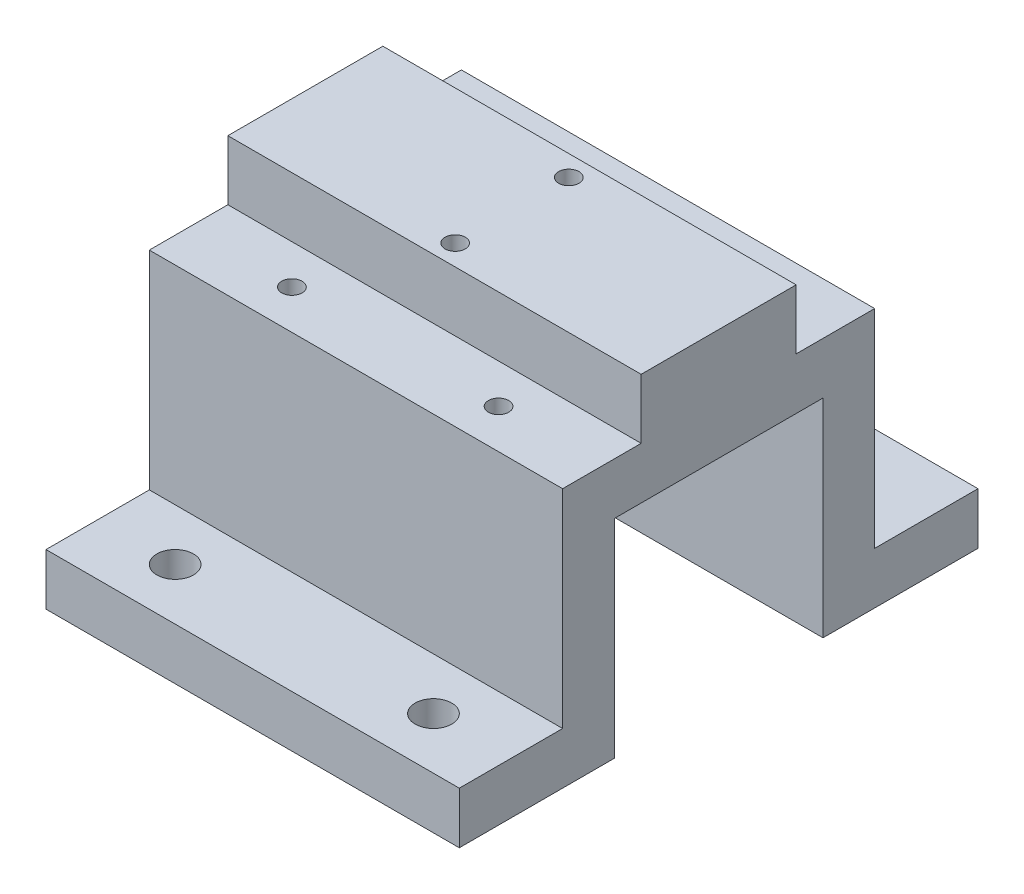
ISO-10303-21;
HEADER;
FILE_DESCRIPTION(('STEP AP214'),'2;1');
FILE_NAME('part.step','',(''),(''),'','','');
FILE_SCHEMA(('AUTOMOTIVE_DESIGN { 1 0 10303 214 1 1 1 1 }'));
ENDSEC;
DATA;
#1=APPLICATION_CONTEXT('core data for automotive mechanical design processes');
#2=APPLICATION_PROTOCOL_DEFINITION('international standard','automotive_design',2000,#1);
#3=PRODUCT_CONTEXT('',#1,'mechanical');
#4=PRODUCT('Part','Part','',(#3));
#5=PRODUCT_RELATED_PRODUCT_CATEGORY('part','',(#4));
#6=PRODUCT_DEFINITION_FORMATION('','',#4);
#7=PRODUCT_DEFINITION_CONTEXT('part definition',#1,'design');
#8=PRODUCT_DEFINITION('design','',#6,#7);
#9=PRODUCT_DEFINITION_SHAPE('','',#8);
#10=(LENGTH_UNIT() NAMED_UNIT(*) SI_UNIT(.MILLI.,.METRE.));
#11=(NAMED_UNIT(*) PLANE_ANGLE_UNIT() SI_UNIT($,.RADIAN.));
#12=(NAMED_UNIT(*) SI_UNIT($,.STERADIAN.) SOLID_ANGLE_UNIT());
#13=UNCERTAINTY_MEASURE_WITH_UNIT(LENGTH_MEASURE(1.E-05),#10,'distance_accuracy_value','');
#14=(GEOMETRIC_REPRESENTATION_CONTEXT(3) GLOBAL_UNCERTAINTY_ASSIGNED_CONTEXT((#13)) GLOBAL_UNIT_ASSIGNED_CONTEXT((#10,
#11,#12)) REPRESENTATION_CONTEXT('',''));
#15=CARTESIAN_POINT('',(0.,0.,0.));
#16=DIRECTION('',(0.,0.,1.));
#17=DIRECTION('',(1.,0.,0.));
#18=AXIS2_PLACEMENT_3D('',#15,#16,#17);
#19=CARTESIAN_POINT('',(50.8,31.877,0.));
#20=DIRECTION('',(0.,-1.,0.));
#21=DIRECTION('',(0.,0.,-1.));
#22=AXIS2_PLACEMENT_3D('',#19,#20,#21);
#23=PLANE('',#22);
#24=CARTESIAN_POINT('',(12.7,31.877,-14.351));
#25=DIRECTION('',(0.,1.,0.));
#26=DIRECTION('',(0.,0.,1.));
#27=AXIS2_PLACEMENT_3D('',#24,#25,#26);
#28=CIRCLE('',#27,1.24999999999999);
#29=CARTESIAN_POINT('',(12.7,31.877,-13.101));
#30=VERTEX_POINT('',#29);
#31=EDGE_CURVE('E388',#30,#30,#28,.T.);
#32=ORIENTED_EDGE('',*,*,#31,.F.);
#33=EDGE_LOOP('',(#32));
#34=FACE_BOUND('',#33,.T.);
#35=CARTESIAN_POINT('',(38.1,31.877,-14.351));
#36=DIRECTION('',(0.,1.,0.));
#37=DIRECTION('',(0.,0.,1.));
#38=AXIS2_PLACEMENT_3D('',#35,#36,#37);
#39=CIRCLE('',#38,1.24999999999999);
#40=CARTESIAN_POINT('',(38.1,31.877,-13.101));
#41=VERTEX_POINT('',#40);
#42=EDGE_CURVE('E424',#41,#41,#39,.T.);
#43=ORIENTED_EDGE('',*,*,#42,.F.);
#44=EDGE_LOOP('',(#43));
#45=FACE_BOUND('',#44,.T.);
#46=DIRECTION('',(-1.,0.,0.));
#47=VECTOR('',#46,1.);
#48=CARTESIAN_POINT('',(50.8,31.877,-9.525));
#49=LINE('',#48,#47);
#50=CARTESIAN_POINT('',(50.8,31.877,-9.525));
#51=VERTEX_POINT('',#50);
#52=CARTESIAN_POINT('',(0.,31.877,-9.525));
#53=VERTEX_POINT('',#52);
#54=EDGE_CURVE('E60',#51,#53,#49,.T.);
#55=ORIENTED_EDGE('',*,*,#54,.F.);
#56=DIRECTION('',(0.,0.,1.));
#57=VECTOR('',#56,1.);
#58=CARTESIAN_POINT('',(50.8,31.877,0.));
#59=LINE('',#58,#57);
#60=CARTESIAN_POINT('',(50.8,31.877,-19.177));
#61=VERTEX_POINT('',#60);
#62=EDGE_CURVE('E231',#61,#51,#59,.T.);
#63=ORIENTED_EDGE('',*,*,#62,.F.);
#64=DIRECTION('',(-1.,0.,0.));
#65=VECTOR('',#64,1.);
#66=CARTESIAN_POINT('',(50.8,31.877,-19.177));
#67=LINE('',#66,#65);
#68=CARTESIAN_POINT('',(0.,31.877,-19.177));
#69=VERTEX_POINT('',#68);
#70=EDGE_CURVE('E11',#61,#69,#67,.T.);
#71=ORIENTED_EDGE('',*,*,#70,.T.);
#72=DIRECTION('',(0.,0.,1.));
#73=VECTOR('',#72,1.);
#74=CARTESIAN_POINT('',(0.,31.877,0.));
#75=LINE('',#74,#73);
#76=EDGE_CURVE('E272',#69,#53,#75,.T.);
#77=ORIENTED_EDGE('',*,*,#76,.T.);
#78=EDGE_LOOP('',(#55,#63,#71,#77));
#79=FACE_BOUND('',#78,.T.);
#80=ADVANCED_FACE('F44',(#34,#45,#79),#23,.F.);
#81=CARTESIAN_POINT('',(12.7,31.877,14.351));
#82=DIRECTION('',(0.,1.,0.));
#83=DIRECTION('',(0.,0.,1.));
#84=AXIS2_PLACEMENT_3D('',#81,#82,#83);
#85=CIRCLE('',#84,1.24999999999999);
#86=CARTESIAN_POINT('',(12.7,31.877,15.601));
#87=VERTEX_POINT('',#86);
#88=EDGE_CURVE('E379',#87,#87,#85,.T.);
#89=ORIENTED_EDGE('',*,*,#88,.F.);
#90=EDGE_LOOP('',(#89));
#91=FACE_BOUND('',#90,.T.);
#92=CARTESIAN_POINT('',(38.1,31.877,14.351));
#93=DIRECTION('',(0.,1.,0.));
#94=DIRECTION('',(0.,0.,1.));
#95=AXIS2_PLACEMENT_3D('',#92,#93,#94);
#96=CIRCLE('',#95,1.24999999999999);
#97=CARTESIAN_POINT('',(38.1,31.877,15.601));
#98=VERTEX_POINT('',#97);
#99=EDGE_CURVE('E389',#98,#98,#96,.T.);
#100=ORIENTED_EDGE('',*,*,#99,.F.);
#101=EDGE_LOOP('',(#100));
#102=FACE_BOUND('',#101,.T.);
#103=DIRECTION('',(1.,0.,0.));
#104=VECTOR('',#103,1.);
#105=CARTESIAN_POINT('',(50.8,31.877,9.525));
#106=LINE('',#105,#104);
#107=CARTESIAN_POINT('',(0.,31.877,9.525));
#108=VERTEX_POINT('',#107);
#109=CARTESIAN_POINT('',(50.8,31.877,9.525));
#110=VERTEX_POINT('',#109);
#111=EDGE_CURVE('E68',#108,#110,#106,.T.);
#112=ORIENTED_EDGE('',*,*,#111,.F.);
#113=CARTESIAN_POINT('',(0.,31.877,19.177));
#114=VERTEX_POINT('',#113);
#115=EDGE_CURVE('E271',#108,#114,#75,.T.);
#116=ORIENTED_EDGE('',*,*,#115,.T.);
#117=DIRECTION('',(-1.,0.,0.));
#118=VECTOR('',#117,1.);
#119=CARTESIAN_POINT('',(50.8,31.877,19.177));
#120=LINE('',#119,#118);
#121=CARTESIAN_POINT('',(50.8,31.877,19.177));
#122=VERTEX_POINT('',#121);
#123=EDGE_CURVE('E53',#122,#114,#120,.T.);
#124=ORIENTED_EDGE('',*,*,#123,.F.);
#125=EDGE_CURVE('E229',#110,#122,#59,.T.);
#126=ORIENTED_EDGE('',*,*,#125,.F.);
#127=EDGE_LOOP('',(#112,#116,#124,#126));
#128=FACE_BOUND('',#127,.T.);
#129=ADVANCED_FACE('F442',(#91,#102,#128),#23,.F.);
#130=CARTESIAN_POINT('',(50.8,0.,-19.177));
#131=DIRECTION('',(0.,0.,-1.));
#132=DIRECTION('',(0.,1.,0.));
#133=AXIS2_PLACEMENT_3D('',#130,#131,#132);
#134=PLANE('',#133);
#135=DIRECTION('',(0.,-1.,0.));
#136=VECTOR('',#135,1.);
#137=CARTESIAN_POINT('',(0.,0.,-19.177));
#138=LINE('',#137,#136);
#139=CARTESIAN_POINT('',(0.,6.35,-19.177));
#140=VERTEX_POINT('',#139);
#141=EDGE_CURVE('E224',#69,#140,#138,.T.);
#142=ORIENTED_EDGE('',*,*,#141,.F.);
#143=ORIENTED_EDGE('',*,*,#70,.F.);
#144=DIRECTION('',(0.,-1.,0.));
#145=VECTOR('',#144,1.);
#146=CARTESIAN_POINT('',(50.8,0.,-19.177));
#147=LINE('',#146,#145);
#148=CARTESIAN_POINT('',(50.8,6.35,-19.177));
#149=VERTEX_POINT('',#148);
#150=EDGE_CURVE('E225',#61,#149,#147,.T.);
#151=ORIENTED_EDGE('',*,*,#150,.T.);
#152=DIRECTION('',(-1.,0.,0.));
#153=VECTOR('',#152,1.);
#154=CARTESIAN_POINT('',(50.8,6.35,-19.177));
#155=LINE('',#154,#153);
#156=EDGE_CURVE('E268',#149,#140,#155,.T.);
#157=ORIENTED_EDGE('',*,*,#156,.T.);
#158=EDGE_LOOP('',(#142,#143,#151,#157));
#159=FACE_BOUND('',#158,.T.);
#160=ADVANCED_FACE('F46',(#159),#134,.T.);
#161=CARTESIAN_POINT('',(50.8,0.,19.177));
#162=DIRECTION('',(0.,0.,-1.));
#163=DIRECTION('',(0.,1.,0.));
#164=AXIS2_PLACEMENT_3D('',#161,#162,#163);
#165=PLANE('',#164);
#166=DIRECTION('',(0.,-1.,0.));
#167=VECTOR('',#166,1.);
#168=CARTESIAN_POINT('',(0.,0.,19.177));
#169=LINE('',#168,#167);
#170=CARTESIAN_POINT('',(0.,6.35,19.177));
#171=VERTEX_POINT('',#170);
#172=EDGE_CURVE('E275',#114,#171,#169,.T.);
#173=ORIENTED_EDGE('',*,*,#172,.T.);
#174=DIRECTION('',(-1.,0.,0.));
#175=VECTOR('',#174,1.);
#176=CARTESIAN_POINT('',(50.8,6.35,19.177));
#177=LINE('',#176,#175);
#178=CARTESIAN_POINT('',(50.8,6.35,19.177));
#179=VERTEX_POINT('',#178);
#180=EDGE_CURVE('E339',#179,#171,#177,.T.);
#181=ORIENTED_EDGE('',*,*,#180,.F.);
#182=DIRECTION('',(0.,-1.,0.));
#183=VECTOR('',#182,1.);
#184=CARTESIAN_POINT('',(50.8,0.,19.177));
#185=LINE('',#184,#183);
#186=EDGE_CURVE('E234',#122,#179,#185,.T.);
#187=ORIENTED_EDGE('',*,*,#186,.F.);
#188=ORIENTED_EDGE('',*,*,#123,.T.);
#189=EDGE_LOOP('',(#173,#181,#187,#188));
#190=FACE_BOUND('',#189,.T.);
#191=ADVANCED_FACE('F349',(#190),#165,.F.);
#192=CARTESIAN_POINT('',(50.8,6.35,0.));
#193=DIRECTION('',(0.,-1.,0.));
#194=DIRECTION('',(0.,0.,-1.));
#195=AXIS2_PLACEMENT_3D('',#192,#193,#194);
#196=PLANE('',#195);
#197=CARTESIAN_POINT('',(9.525,6.35,25.527));
#198=DIRECTION('',(0.,1.,0.));
#199=DIRECTION('',(0.,0.,1.));
#200=AXIS2_PLACEMENT_3D('',#197,#198,#199);
#201=CIRCLE('',#200,2.24999999999999);
#202=CARTESIAN_POINT('',(9.525,6.35,27.777));
#203=VERTEX_POINT('',#202);
#204=EDGE_CURVE('E399',#203,#203,#201,.T.);
#205=ORIENTED_EDGE('',*,*,#204,.F.);
#206=EDGE_LOOP('',(#205));
#207=FACE_BOUND('',#206,.T.);
#208=CARTESIAN_POINT('',(41.275,6.35,25.527));
#209=DIRECTION('',(0.,1.,0.));
#210=DIRECTION('',(0.,0.,1.));
#211=AXIS2_PLACEMENT_3D('',#208,#209,#210);
#212=CIRCLE('',#211,2.24999999999999);
#213=CARTESIAN_POINT('',(41.275,6.35,27.777));
#214=VERTEX_POINT('',#213);
#215=EDGE_CURVE('E383',#214,#214,#212,.T.);
#216=ORIENTED_EDGE('',*,*,#215,.F.);
#217=EDGE_LOOP('',(#216));
#218=FACE_BOUND('',#217,.T.);
#219=DIRECTION('',(0.,0.,1.));
#220=VECTOR('',#219,1.);
#221=CARTESIAN_POINT('',(0.,6.35,0.));
#222=LINE('',#221,#220);
#223=CARTESIAN_POINT('',(0.,6.35,31.877));
#224=VERTEX_POINT('',#223);
#225=EDGE_CURVE('E278',#171,#224,#222,.T.);
#226=ORIENTED_EDGE('',*,*,#225,.T.);
#227=DIRECTION('',(-1.,0.,0.));
#228=VECTOR('',#227,1.);
#229=CARTESIAN_POINT('',(50.8,6.35,31.877));
#230=LINE('',#229,#228);
#231=CARTESIAN_POINT('',(50.8,6.35,31.877));
#232=VERTEX_POINT('',#231);
#233=EDGE_CURVE('E336',#232,#224,#230,.T.);
#234=ORIENTED_EDGE('',*,*,#233,.F.);
#235=DIRECTION('',(0.,0.,1.));
#236=VECTOR('',#235,1.);
#237=CARTESIAN_POINT('',(50.8,6.35,0.));
#238=LINE('',#237,#236);
#239=EDGE_CURVE('E237',#179,#232,#238,.T.);
#240=ORIENTED_EDGE('',*,*,#239,.F.);
#241=ORIENTED_EDGE('',*,*,#180,.T.);
#242=EDGE_LOOP('',(#226,#234,#240,#241));
#243=FACE_BOUND('',#242,.T.);
#244=ADVANCED_FACE('F359',(#207,#218,#243),#196,.F.);
#245=CARTESIAN_POINT('',(50.8,0.,31.877));
#246=DIRECTION('',(0.,0.,1.));
#247=DIRECTION('',(1.,0.,0.));
#248=AXIS2_PLACEMENT_3D('',#245,#246,#247);
#249=PLANE('',#248);
#250=DIRECTION('',(0.,1.,0.));
#251=VECTOR('',#250,1.);
#252=CARTESIAN_POINT('',(0.,0.,31.877));
#253=LINE('',#252,#251);
#254=CARTESIAN_POINT('',(0.,0.,31.877));
#255=VERTEX_POINT('',#254);
#256=EDGE_CURVE('E282',#255,#224,#253,.T.);
#257=ORIENTED_EDGE('',*,*,#256,.F.);
#258=DIRECTION('',(-1.,0.,0.));
#259=VECTOR('',#258,1.);
#260=CARTESIAN_POINT('',(50.8,0.,31.877));
#261=LINE('',#260,#259);
#262=CARTESIAN_POINT('',(50.8,0.,31.877));
#263=VERTEX_POINT('',#262);
#264=EDGE_CURVE('E333',#263,#255,#261,.T.);
#265=ORIENTED_EDGE('',*,*,#264,.F.);
#266=DIRECTION('',(0.,1.,0.));
#267=VECTOR('',#266,1.);
#268=CARTESIAN_POINT('',(50.8,0.,31.877));
#269=LINE('',#268,#267);
#270=EDGE_CURVE('E240',#263,#232,#269,.T.);
#271=ORIENTED_EDGE('',*,*,#270,.T.);
#272=ORIENTED_EDGE('',*,*,#233,.T.);
#273=EDGE_LOOP('',(#257,#265,#271,#272));
#274=FACE_BOUND('',#273,.T.);
#275=ADVANCED_FACE('F454',(#274),#249,.T.);
#276=CARTESIAN_POINT('',(50.8,0.,0.));
#277=DIRECTION('',(0.,1.,0.));
#278=DIRECTION('',(0.,0.,1.));
#279=AXIS2_PLACEMENT_3D('',#276,#277,#278);
#280=PLANE('',#279);
#281=CARTESIAN_POINT('',(9.525,0.,25.527));
#282=DIRECTION('',(0.,1.,0.));
#283=DIRECTION('',(0.,0.,1.));
#284=AXIS2_PLACEMENT_3D('',#281,#282,#283);
#285=CIRCLE('',#284,2.25);
#286=CARTESIAN_POINT('',(9.525,0.,27.777));
#287=VERTEX_POINT('',#286);
#288=EDGE_CURVE('E396',#287,#287,#285,.T.);
#289=ORIENTED_EDGE('',*,*,#288,.T.);
#290=EDGE_LOOP('',(#289));
#291=FACE_BOUND('',#290,.T.);
#292=CARTESIAN_POINT('',(41.275,0.,25.527));
#293=DIRECTION('',(0.,1.,0.));
#294=DIRECTION('',(0.,0.,1.));
#295=AXIS2_PLACEMENT_3D('',#292,#293,#294);
#296=CIRCLE('',#295,2.25);
#297=CARTESIAN_POINT('',(41.275,0.,27.777));
#298=VERTEX_POINT('',#297);
#299=EDGE_CURVE('E373',#298,#298,#296,.T.);
#300=ORIENTED_EDGE('',*,*,#299,.T.);
#301=EDGE_LOOP('',(#300));
#302=FACE_BOUND('',#301,.T.);
#303=CARTESIAN_POINT('',(12.7,0.,14.351));
#304=DIRECTION('',(0.,1.,0.));
#305=DIRECTION('',(0.,0.,1.));
#306=AXIS2_PLACEMENT_3D('',#303,#304,#305);
#307=CIRCLE('',#306,1.25);
#308=CARTESIAN_POINT('',(12.7,0.,15.601));
#309=VERTEX_POINT('',#308);
#310=EDGE_CURVE('E393',#309,#309,#307,.T.);
#311=ORIENTED_EDGE('',*,*,#310,.T.);
#312=EDGE_LOOP('',(#311));
#313=FACE_BOUND('',#312,.T.);
#314=CARTESIAN_POINT('',(38.1,0.,14.351));
#315=DIRECTION('',(0.,1.,0.));
#316=DIRECTION('',(0.,0.,1.));
#317=AXIS2_PLACEMENT_3D('',#314,#315,#316);
#318=CIRCLE('',#317,1.24999999999999);
#319=CARTESIAN_POINT('',(38.1,0.,15.601));
#320=VERTEX_POINT('',#319);
#321=EDGE_CURVE('E386',#320,#320,#318,.T.);
#322=ORIENTED_EDGE('',*,*,#321,.T.);
#323=EDGE_LOOP('',(#322));
#324=FACE_BOUND('',#323,.T.);
#325=DIRECTION('',(0.,0.,-1.));
#326=VECTOR('',#325,1.);
#327=CARTESIAN_POINT('',(0.,0.,0.));
#328=LINE('',#327,#326);
#329=CARTESIAN_POINT('',(0.,0.,12.827));
#330=VERTEX_POINT('',#329);
#331=EDGE_CURVE('E286',#255,#330,#328,.T.);
#332=ORIENTED_EDGE('',*,*,#331,.T.);
#333=DIRECTION('',(-1.,0.,0.));
#334=VECTOR('',#333,1.);
#335=CARTESIAN_POINT('',(50.8,0.,12.827));
#336=LINE('',#335,#334);
#337=CARTESIAN_POINT('',(50.8,0.,12.827));
#338=VERTEX_POINT('',#337);
#339=EDGE_CURVE('E329',#338,#330,#336,.T.);
#340=ORIENTED_EDGE('',*,*,#339,.F.);
#341=DIRECTION('',(0.,0.,-1.));
#342=VECTOR('',#341,1.);
#343=CARTESIAN_POINT('',(50.8,0.,0.));
#344=LINE('',#343,#342);
#345=EDGE_CURVE('E244',#263,#338,#344,.T.);
#346=ORIENTED_EDGE('',*,*,#345,.F.);
#347=ORIENTED_EDGE('',*,*,#264,.T.);
#348=EDGE_LOOP('',(#332,#340,#346,#347));
#349=FACE_BOUND('',#348,.T.);
#350=ADVANCED_FACE('F458',(#291,#302,#313,#324,#349),#280,.F.);
#351=CARTESIAN_POINT('',(50.8,0.,12.827));
#352=DIRECTION('',(0.,0.,1.));
#353=DIRECTION('',(1.,0.,0.));
#354=AXIS2_PLACEMENT_3D('',#351,#352,#353);
#355=PLANE('',#354);
#356=DIRECTION('',(0.,1.,0.));
#357=VECTOR('',#356,1.);
#358=CARTESIAN_POINT('',(0.,0.,12.827));
#359=LINE('',#358,#357);
#360=CARTESIAN_POINT('',(0.,25.527,12.827));
#361=VERTEX_POINT('',#360);
#362=EDGE_CURVE('E289',#330,#361,#359,.T.);
#363=ORIENTED_EDGE('',*,*,#362,.T.);
#364=DIRECTION('',(-1.,0.,0.));
#365=VECTOR('',#364,1.);
#366=CARTESIAN_POINT('',(50.8,25.527,12.827));
#367=LINE('',#366,#365);
#368=CARTESIAN_POINT('',(50.8,25.527,12.827));
#369=VERTEX_POINT('',#368);
#370=EDGE_CURVE('E325',#369,#361,#367,.T.);
#371=ORIENTED_EDGE('',*,*,#370,.F.);
#372=DIRECTION('',(0.,1.,0.));
#373=VECTOR('',#372,1.);
#374=CARTESIAN_POINT('',(50.8,0.,12.827));
#375=LINE('',#374,#373);
#376=EDGE_CURVE('E247',#338,#369,#375,.T.);
#377=ORIENTED_EDGE('',*,*,#376,.F.);
#378=ORIENTED_EDGE('',*,*,#339,.T.);
#379=EDGE_LOOP('',(#363,#371,#377,#378));
#380=FACE_BOUND('',#379,.T.);
#381=ADVANCED_FACE('F462',(#380),#355,.F.);
#382=CARTESIAN_POINT('',(50.8,25.527,0.));
#383=DIRECTION('',(0.,1.,0.));
#384=DIRECTION('',(0.,0.,1.));
#385=AXIS2_PLACEMENT_3D('',#382,#383,#384);
#386=PLANE('',#385);
#387=DIRECTION('',(0.,0.,-1.));
#388=VECTOR('',#387,1.);
#389=CARTESIAN_POINT('',(0.,25.527,0.));
#390=LINE('',#389,#388);
#391=CARTESIAN_POINT('',(0.,25.527,-12.827));
#392=VERTEX_POINT('',#391);
#393=EDGE_CURVE('E292',#361,#392,#390,.T.);
#394=ORIENTED_EDGE('',*,*,#393,.T.);
#395=DIRECTION('',(-1.,0.,0.));
#396=VECTOR('',#395,1.);
#397=CARTESIAN_POINT('',(50.8,25.527,-12.827));
#398=LINE('',#397,#396);
#399=CARTESIAN_POINT('',(50.8,25.527,-12.827));
#400=VERTEX_POINT('',#399);
#401=EDGE_CURVE('E322',#400,#392,#398,.T.);
#402=ORIENTED_EDGE('',*,*,#401,.F.);
#403=DIRECTION('',(0.,0.,-1.));
#404=VECTOR('',#403,1.);
#405=CARTESIAN_POINT('',(50.8,25.527,0.));
#406=LINE('',#405,#404);
#407=EDGE_CURVE('E250',#369,#400,#406,.T.);
#408=ORIENTED_EDGE('',*,*,#407,.F.);
#409=ORIENTED_EDGE('',*,*,#370,.T.);
#410=EDGE_LOOP('',(#394,#402,#408,#409));
#411=FACE_BOUND('',#410,.T.);
#412=ADVANCED_FACE('F466',(#411),#386,.F.);
#413=CARTESIAN_POINT('',(50.8,0.,-12.827));
#414=DIRECTION('',(0.,0.,1.));
#415=DIRECTION('',(1.,0.,0.));
#416=AXIS2_PLACEMENT_3D('',#413,#414,#415);
#417=PLANE('',#416);
#418=DIRECTION('',(0.,1.,0.));
#419=VECTOR('',#418,1.);
#420=CARTESIAN_POINT('',(0.,0.,-12.827));
#421=LINE('',#420,#419);
#422=CARTESIAN_POINT('',(0.,0.,-12.827));
#423=VERTEX_POINT('',#422);
#424=EDGE_CURVE('E296',#423,#392,#421,.T.);
#425=ORIENTED_EDGE('',*,*,#424,.F.);
#426=DIRECTION('',(-1.,0.,0.));
#427=VECTOR('',#426,1.);
#428=CARTESIAN_POINT('',(50.8,0.,-12.827));
#429=LINE('',#428,#427);
#430=CARTESIAN_POINT('',(50.8,0.,-12.827));
#431=VERTEX_POINT('',#430);
#432=EDGE_CURVE('E319',#431,#423,#429,.T.);
#433=ORIENTED_EDGE('',*,*,#432,.F.);
#434=DIRECTION('',(0.,1.,0.));
#435=VECTOR('',#434,1.);
#436=CARTESIAN_POINT('',(50.8,0.,-12.827));
#437=LINE('',#436,#435);
#438=EDGE_CURVE('E253',#431,#400,#437,.T.);
#439=ORIENTED_EDGE('',*,*,#438,.T.);
#440=ORIENTED_EDGE('',*,*,#401,.T.);
#441=EDGE_LOOP('',(#425,#433,#439,#440));
#442=FACE_BOUND('',#441,.T.);
#443=ADVANCED_FACE('F470',(#442),#417,.T.);
#444=CARTESIAN_POINT('',(50.8,0.,0.));
#445=DIRECTION('',(0.,-1.,0.));
#446=DIRECTION('',(0.,0.,-1.));
#447=AXIS2_PLACEMENT_3D('',#444,#445,#446);
#448=PLANE('',#447);
#449=CARTESIAN_POINT('',(9.525,0.,-25.527));
#450=DIRECTION('',(0.,1.,0.));
#451=DIRECTION('',(0.,0.,1.));
#452=AXIS2_PLACEMENT_3D('',#449,#450,#451);
#453=CIRCLE('',#452,2.25);
#454=CARTESIAN_POINT('',(9.525,0.,-23.277));
#455=VERTEX_POINT('',#454);
#456=EDGE_CURVE('E372',#455,#455,#453,.T.);
#457=ORIENTED_EDGE('',*,*,#456,.T.);
#458=EDGE_LOOP('',(#457));
#459=FACE_BOUND('',#458,.T.);
#460=CARTESIAN_POINT('',(41.275,0.,-25.527));
#461=DIRECTION('',(0.,1.,0.));
#462=DIRECTION('',(0.,0.,1.));
#463=AXIS2_PLACEMENT_3D('',#460,#461,#462);
#464=CIRCLE('',#463,2.25);
#465=CARTESIAN_POINT('',(41.275,0.,-23.277));
#466=VERTEX_POINT('',#465);
#467=EDGE_CURVE('E376',#466,#466,#464,.T.);
#468=ORIENTED_EDGE('',*,*,#467,.T.);
#469=EDGE_LOOP('',(#468));
#470=FACE_BOUND('',#469,.T.);
#471=CARTESIAN_POINT('',(12.7,0.,-14.351));
#472=DIRECTION('',(0.,1.,0.));
#473=DIRECTION('',(0.,0.,1.));
#474=AXIS2_PLACEMENT_3D('',#471,#472,#473);
#475=CIRCLE('',#474,1.25);
#476=CARTESIAN_POINT('',(12.7,0.,-13.101));
#477=VERTEX_POINT('',#476);
#478=EDGE_CURVE('E420',#477,#477,#475,.T.);
#479=ORIENTED_EDGE('',*,*,#478,.T.);
#480=EDGE_LOOP('',(#479));
#481=FACE_BOUND('',#480,.T.);
#482=CARTESIAN_POINT('',(38.1,0.,-14.351));
#483=DIRECTION('',(0.,1.,0.));
#484=DIRECTION('',(0.,0.,1.));
#485=AXIS2_PLACEMENT_3D('',#482,#483,#484);
#486=CIRCLE('',#485,1.24999999999999);
#487=CARTESIAN_POINT('',(38.1,0.,-13.101));
#488=VERTEX_POINT('',#487);
#489=EDGE_CURVE('E184',#488,#488,#486,.T.);
#490=ORIENTED_EDGE('',*,*,#489,.T.);
#491=EDGE_LOOP('',(#490));
#492=FACE_BOUND('',#491,.T.);
#493=DIRECTION('',(0.,0.,1.));
#494=VECTOR('',#493,1.);
#495=CARTESIAN_POINT('',(0.,0.,0.));
#496=LINE('',#495,#494);
#497=CARTESIAN_POINT('',(0.,0.,-31.877));
#498=VERTEX_POINT('',#497);
#499=EDGE_CURVE('E300',#498,#423,#496,.T.);
#500=ORIENTED_EDGE('',*,*,#499,.F.);
#501=DIRECTION('',(-1.,0.,0.));
#502=VECTOR('',#501,1.);
#503=CARTESIAN_POINT('',(50.8,0.,-31.877));
#504=LINE('',#503,#502);
#505=CARTESIAN_POINT('',(50.8,0.,-31.877));
#506=VERTEX_POINT('',#505);
#507=EDGE_CURVE('E316',#506,#498,#504,.T.);
#508=ORIENTED_EDGE('',*,*,#507,.F.);
#509=DIRECTION('',(0.,0.,1.));
#510=VECTOR('',#509,1.);
#511=CARTESIAN_POINT('',(50.8,0.,0.));
#512=LINE('',#511,#510);
#513=EDGE_CURVE('E257',#506,#431,#512,.T.);
#514=ORIENTED_EDGE('',*,*,#513,.T.);
#515=ORIENTED_EDGE('',*,*,#432,.T.);
#516=EDGE_LOOP('',(#500,#508,#514,#515));
#517=FACE_BOUND('',#516,.T.);
#518=ADVANCED_FACE('F431',(#459,#470,#481,#492,#517),#448,.T.);
#519=CARTESIAN_POINT('',(50.8,0.,-31.877));
#520=DIRECTION('',(0.,0.,1.));
#521=DIRECTION('',(1.,0.,0.));
#522=AXIS2_PLACEMENT_3D('',#519,#520,#521);
#523=PLANE('',#522);
#524=DIRECTION('',(0.,1.,0.));
#525=VECTOR('',#524,1.);
#526=CARTESIAN_POINT('',(0.,0.,-31.877));
#527=LINE('',#526,#525);
#528=CARTESIAN_POINT('',(0.,6.35,-31.877));
#529=VERTEX_POINT('',#528);
#530=EDGE_CURVE('E304',#498,#529,#527,.T.);
#531=ORIENTED_EDGE('',*,*,#530,.T.);
#532=DIRECTION('',(-1.,0.,0.));
#533=VECTOR('',#532,1.);
#534=CARTESIAN_POINT('',(50.8,6.35,-31.877));
#535=LINE('',#534,#533);
#536=CARTESIAN_POINT('',(50.8,6.35,-31.877));
#537=VERTEX_POINT('',#536);
#538=EDGE_CURVE('E313',#537,#529,#535,.T.);
#539=ORIENTED_EDGE('',*,*,#538,.F.);
#540=DIRECTION('',(0.,1.,0.));
#541=VECTOR('',#540,1.);
#542=CARTESIAN_POINT('',(50.8,0.,-31.877));
#543=LINE('',#542,#541);
#544=EDGE_CURVE('E261',#506,#537,#543,.T.);
#545=ORIENTED_EDGE('',*,*,#544,.F.);
#546=ORIENTED_EDGE('',*,*,#507,.T.);
#547=EDGE_LOOP('',(#531,#539,#545,#546));
#548=FACE_BOUND('',#547,.T.);
#549=ADVANCED_FACE('F477',(#548),#523,.F.);
#550=CARTESIAN_POINT('',(50.8,6.35,0.));
#551=DIRECTION('',(0.,1.,0.));
#552=DIRECTION('',(0.,0.,1.));
#553=AXIS2_PLACEMENT_3D('',#550,#551,#552);
#554=PLANE('',#553);
#555=CARTESIAN_POINT('',(9.525,6.35,-25.527));
#556=DIRECTION('',(0.,1.,0.));
#557=DIRECTION('',(0.,0.,1.));
#558=AXIS2_PLACEMENT_3D('',#555,#556,#557);
#559=CIRCLE('',#558,2.24999999999999);
#560=CARTESIAN_POINT('',(9.525,6.35,-23.277));
#561=VERTEX_POINT('',#560);
#562=EDGE_CURVE('E370',#561,#561,#559,.T.);
#563=ORIENTED_EDGE('',*,*,#562,.F.);
#564=EDGE_LOOP('',(#563));
#565=FACE_BOUND('',#564,.T.);
#566=CARTESIAN_POINT('',(41.275,6.35,-25.527));
#567=DIRECTION('',(0.,1.,0.));
#568=DIRECTION('',(0.,0.,1.));
#569=AXIS2_PLACEMENT_3D('',#566,#567,#568);
#570=CIRCLE('',#569,2.24999999999999);
#571=CARTESIAN_POINT('',(41.275,6.35,-23.277));
#572=VERTEX_POINT('',#571);
#573=EDGE_CURVE('E380',#572,#572,#570,.T.);
#574=ORIENTED_EDGE('',*,*,#573,.F.);
#575=EDGE_LOOP('',(#574));
#576=FACE_BOUND('',#575,.T.);
#577=DIRECTION('',(0.,0.,-1.));
#578=VECTOR('',#577,1.);
#579=CARTESIAN_POINT('',(0.,6.35,0.));
#580=LINE('',#579,#578);
#581=EDGE_CURVE('E230',#140,#529,#580,.T.);
#582=ORIENTED_EDGE('',*,*,#581,.F.);
#583=ORIENTED_EDGE('',*,*,#156,.F.);
#584=DIRECTION('',(0.,0.,-1.));
#585=VECTOR('',#584,1.);
#586=CARTESIAN_POINT('',(50.8,6.35,0.));
#587=LINE('',#586,#585);
#588=EDGE_CURVE('E264',#149,#537,#587,.T.);
#589=ORIENTED_EDGE('',*,*,#588,.T.);
#590=ORIENTED_EDGE('',*,*,#538,.T.);
#591=EDGE_LOOP('',(#582,#583,#589,#590));
#592=FACE_BOUND('',#591,.T.);
#593=ADVANCED_FACE('F481',(#565,#576,#592),#554,.T.);
#594=CARTESIAN_POINT('',(50.8,0.,0.));
#595=DIRECTION('',(1.,0.,0.));
#596=DIRECTION('',(0.,0.,-1.));
#597=AXIS2_PLACEMENT_3D('',#594,#595,#596);
#598=PLANE('',#597);
#599=ORIENTED_EDGE('',*,*,#150,.F.);
#600=ORIENTED_EDGE('',*,*,#62,.T.);
#601=DIRECTION('',(0.,-1.,0.));
#602=VECTOR('',#601,1.);
#603=CARTESIAN_POINT('',(50.8,39.22776,-9.525));
#604=LINE('',#603,#602);
#605=CARTESIAN_POINT('',(50.8,39.22776,-9.525));
#606=VERTEX_POINT('',#605);
#607=EDGE_CURVE('E212',#606,#51,#604,.T.);
#608=ORIENTED_EDGE('',*,*,#607,.F.);
#609=DIRECTION('',(0.,0.,-1.));
#610=VECTOR('',#609,1.);
#611=CARTESIAN_POINT('',(50.8,39.22776,9.525));
#612=LINE('',#611,#610);
#613=CARTESIAN_POINT('',(50.8,39.22776,9.525));
#614=VERTEX_POINT('',#613);
#615=EDGE_CURVE('E198',#614,#606,#612,.T.);
#616=ORIENTED_EDGE('',*,*,#615,.F.);
#617=DIRECTION('',(0.,-1.,0.));
#618=VECTOR('',#617,1.);
#619=CARTESIAN_POINT('',(50.8,39.22776,9.525));
#620=LINE('',#619,#618);
#621=EDGE_CURVE('E216',#614,#110,#620,.T.);
#622=ORIENTED_EDGE('',*,*,#621,.T.);
#623=ORIENTED_EDGE('',*,*,#125,.T.);
#624=ORIENTED_EDGE('',*,*,#186,.T.);
#625=ORIENTED_EDGE('',*,*,#239,.T.);
#626=ORIENTED_EDGE('',*,*,#270,.F.);
#627=ORIENTED_EDGE('',*,*,#345,.T.);
#628=ORIENTED_EDGE('',*,*,#376,.T.);
#629=ORIENTED_EDGE('',*,*,#407,.T.);
#630=ORIENTED_EDGE('',*,*,#438,.F.);
#631=ORIENTED_EDGE('',*,*,#513,.F.);
#632=ORIENTED_EDGE('',*,*,#544,.T.);
#633=ORIENTED_EDGE('',*,*,#588,.F.);
#634=EDGE_LOOP('',(#599,#600,#608,#616,#622,#623,#624,#625,#626,#627,#628,#629,#630,#631,#632,#633));
#635=FACE_BOUND('',#634,.T.);
#636=ADVANCED_FACE('F364',(#635),#598,.T.);
#637=CARTESIAN_POINT('',(0.,0.,0.));
#638=DIRECTION('',(1.,0.,0.));
#639=DIRECTION('',(0.,0.,-1.));
#640=AXIS2_PLACEMENT_3D('',#637,#638,#639);
#641=PLANE('',#640);
#642=ORIENTED_EDGE('',*,*,#141,.T.);
#643=ORIENTED_EDGE('',*,*,#581,.T.);
#644=ORIENTED_EDGE('',*,*,#530,.F.);
#645=ORIENTED_EDGE('',*,*,#499,.T.);
#646=ORIENTED_EDGE('',*,*,#424,.T.);
#647=ORIENTED_EDGE('',*,*,#393,.F.);
#648=ORIENTED_EDGE('',*,*,#362,.F.);
#649=ORIENTED_EDGE('',*,*,#331,.F.);
#650=ORIENTED_EDGE('',*,*,#256,.T.);
#651=ORIENTED_EDGE('',*,*,#225,.F.);
#652=ORIENTED_EDGE('',*,*,#172,.F.);
#653=ORIENTED_EDGE('',*,*,#115,.F.);
#654=DIRECTION('',(0.,-1.,0.));
#655=VECTOR('',#654,1.);
#656=CARTESIAN_POINT('',(0.,39.22776,9.525));
#657=LINE('',#656,#655);
#658=CARTESIAN_POINT('',(0.,39.22776,9.525));
#659=VERTEX_POINT('',#658);
#660=EDGE_CURVE('E220',#659,#108,#657,.T.);
#661=ORIENTED_EDGE('',*,*,#660,.F.);
#662=DIRECTION('',(0.,0.,1.));
#663=VECTOR('',#662,1.);
#664=CARTESIAN_POINT('',(0.,39.22776,9.525));
#665=LINE('',#664,#663);
#666=CARTESIAN_POINT('',(0.,39.22776,-9.525));
#667=VERTEX_POINT('',#666);
#668=EDGE_CURVE('E191',#667,#659,#665,.T.);
#669=ORIENTED_EDGE('',*,*,#668,.F.);
#670=DIRECTION('',(0.,-1.,0.));
#671=VECTOR('',#670,1.);
#672=CARTESIAN_POINT('',(0.,39.22776,-9.525));
#673=LINE('',#672,#671);
#674=EDGE_CURVE('E204',#667,#53,#673,.T.);
#675=ORIENTED_EDGE('',*,*,#674,.T.);
#676=ORIENTED_EDGE('',*,*,#76,.F.);
#677=EDGE_LOOP('',(#642,#643,#644,#645,#646,#647,#648,#649,#650,#651,#652,#653,#661,#669,#675,#676));
#678=FACE_BOUND('',#677,.T.);
#679=ADVANCED_FACE('F353',(#678),#641,.F.);
#680=CARTESIAN_POINT('',(50.8,39.22776,9.525));
#681=DIRECTION('',(0.,0.,-1.));
#682=DIRECTION('',(-1.,0.,0.));
#683=AXIS2_PLACEMENT_3D('',#680,#681,#682);
#684=PLANE('',#683);
#685=ORIENTED_EDGE('',*,*,#111,.T.);
#686=ORIENTED_EDGE('',*,*,#621,.F.);
#687=DIRECTION('',(1.,0.,0.));
#688=VECTOR('',#687,1.);
#689=CARTESIAN_POINT('',(50.8,39.22776,9.525));
#690=LINE('',#689,#688);
#691=EDGE_CURVE('E195',#659,#614,#690,.T.);
#692=ORIENTED_EDGE('',*,*,#691,.F.);
#693=ORIENTED_EDGE('',*,*,#660,.T.);
#694=EDGE_LOOP('',(#685,#686,#692,#693));
#695=FACE_BOUND('',#694,.T.);
#696=ADVANCED_FACE('F488',(#695),#684,.F.);
#697=CARTESIAN_POINT('',(50.8,39.22776,-9.525));
#698=DIRECTION('',(0.,0.,1.));
#699=DIRECTION('',(1.,0.,0.));
#700=AXIS2_PLACEMENT_3D('',#697,#698,#699);
#701=PLANE('',#700);
#702=ORIENTED_EDGE('',*,*,#54,.T.);
#703=ORIENTED_EDGE('',*,*,#674,.F.);
#704=DIRECTION('',(-1.,0.,0.));
#705=VECTOR('',#704,1.);
#706=CARTESIAN_POINT('',(50.8,39.22776,-9.525));
#707=LINE('',#706,#705);
#708=EDGE_CURVE('E201',#606,#667,#707,.T.);
#709=ORIENTED_EDGE('',*,*,#708,.F.);
#710=ORIENTED_EDGE('',*,*,#607,.T.);
#711=EDGE_LOOP('',(#702,#703,#709,#710));
#712=FACE_BOUND('',#711,.T.);
#713=ADVANCED_FACE('F493',(#712),#701,.F.);
#714=CARTESIAN_POINT('',(0.,39.22776,0.));
#715=DIRECTION('',(0.,1.,0.));
#716=DIRECTION('',(0.,0.,1.));
#717=AXIS2_PLACEMENT_3D('',#714,#715,#716);
#718=PLANE('',#717);
#719=CARTESIAN_POINT('',(25.4,39.22776,-6.985));
#720=DIRECTION('',(0.,1.,0.));
#721=DIRECTION('',(0.,0.,1.));
#722=AXIS2_PLACEMENT_3D('',#719,#720,#721);
#723=CIRCLE('',#722,1.24999999999999);
#724=CARTESIAN_POINT('',(25.4,39.22776,-5.73500000000001));
#725=VERTEX_POINT('',#724);
#726=EDGE_CURVE('E174',#725,#725,#723,.T.);
#727=ORIENTED_EDGE('',*,*,#726,.F.);
#728=EDGE_LOOP('',(#727));
#729=FACE_BOUND('',#728,.T.);
#730=CARTESIAN_POINT('',(25.4,39.22776,6.985));
#731=DIRECTION('',(0.,1.,0.));
#732=DIRECTION('',(0.,0.,1.));
#733=AXIS2_PLACEMENT_3D('',#730,#731,#732);
#734=CIRCLE('',#733,1.24999999999999);
#735=CARTESIAN_POINT('',(25.4,39.22776,8.23499999999999));
#736=VERTEX_POINT('',#735);
#737=EDGE_CURVE('E173',#736,#736,#734,.T.);
#738=ORIENTED_EDGE('',*,*,#737,.F.);
#739=EDGE_LOOP('',(#738));
#740=FACE_BOUND('',#739,.T.);
#741=ORIENTED_EDGE('',*,*,#668,.T.);
#742=ORIENTED_EDGE('',*,*,#691,.T.);
#743=ORIENTED_EDGE('',*,*,#615,.T.);
#744=ORIENTED_EDGE('',*,*,#708,.T.);
#745=EDGE_LOOP('',(#741,#742,#743,#744));
#746=FACE_BOUND('',#745,.T.);
#747=ADVANCED_FACE('F497',(#729,#740,#746),#718,.T.);
#748=CARTESIAN_POINT('',(25.4,32.87776,6.985));
#749=DIRECTION('',(0.,1.,0.));
#750=DIRECTION('',(0.,0.,1.));
#751=AXIS2_PLACEMENT_3D('',#748,#749,#750);
#752=CONICAL_SURFACE('',#751,1.25,1.02974425867665);
#753=CARTESIAN_POINT('',(25.4,32.1266842262155,6.985));
#754=VERTEX_POINT('',#753);
#755=VERTEX_LOOP('',#754);
#756=FACE_BOUND('',#755,.T.);
#757=CARTESIAN_POINT('',(25.4,32.87776,6.985));
#758=DIRECTION('',(0.,1.,0.));
#759=DIRECTION('',(0.,0.,1.));
#760=AXIS2_PLACEMENT_3D('',#757,#758,#759);
#761=CIRCLE('',#760,1.25);
#762=CARTESIAN_POINT('',(25.4,32.87776,8.235));
#763=VERTEX_POINT('',#762);
#764=EDGE_CURVE('E180',#763,#763,#761,.T.);
#765=ORIENTED_EDGE('',*,*,#764,.T.);
#766=EDGE_LOOP('',(#765));
#767=FACE_BOUND('',#766,.T.);
#768=ADVANCED_FACE('F501',(#756,#767),#752,.F.);
#769=CARTESIAN_POINT('',(25.4,39.22776,6.985));
#770=DIRECTION('',(0.,1.,0.));
#771=DIRECTION('',(0.,0.,1.));
#772=AXIS2_PLACEMENT_3D('',#769,#770,#771);
#773=CYLINDRICAL_SURFACE('',#772,1.24999999999999);
#774=ORIENTED_EDGE('',*,*,#764,.F.);
#775=EDGE_LOOP('',(#774));
#776=FACE_BOUND('',#775,.T.);
#777=ORIENTED_EDGE('',*,*,#737,.T.);
#778=EDGE_LOOP('',(#777));
#779=FACE_BOUND('',#778,.T.);
#780=ADVANCED_FACE('F166',(#776,#779),#773,.F.);
#781=CARTESIAN_POINT('',(25.4,32.87776,-6.985));
#782=DIRECTION('',(0.,1.,0.));
#783=DIRECTION('',(0.,0.,1.));
#784=AXIS2_PLACEMENT_3D('',#781,#782,#783);
#785=CONICAL_SURFACE('',#784,1.25,1.02974425867665);
#786=CARTESIAN_POINT('',(25.4,32.1266842262155,-6.985));
#787=VERTEX_POINT('',#786);
#788=VERTEX_LOOP('',#787);
#789=FACE_BOUND('',#788,.T.);
#790=CARTESIAN_POINT('',(25.4,32.87776,-6.985));
#791=DIRECTION('',(0.,1.,0.));
#792=DIRECTION('',(0.,0.,1.));
#793=AXIS2_PLACEMENT_3D('',#790,#791,#792);
#794=CIRCLE('',#793,1.25);
#795=CARTESIAN_POINT('',(25.4,32.87776,-5.735));
#796=VERTEX_POINT('',#795);
#797=EDGE_CURVE('E170',#796,#796,#794,.T.);
#798=ORIENTED_EDGE('',*,*,#797,.T.);
#799=EDGE_LOOP('',(#798));
#800=FACE_BOUND('',#799,.T.);
#801=ADVANCED_FACE('F162',(#789,#800),#785,.F.);
#802=CARTESIAN_POINT('',(25.4,39.22776,-6.985));
#803=DIRECTION('',(0.,1.,0.));
#804=DIRECTION('',(0.,0.,1.));
#805=AXIS2_PLACEMENT_3D('',#802,#803,#804);
#806=CYLINDRICAL_SURFACE('',#805,1.24999999999999);
#807=ORIENTED_EDGE('',*,*,#797,.F.);
#808=EDGE_LOOP('',(#807));
#809=FACE_BOUND('',#808,.T.);
#810=ORIENTED_EDGE('',*,*,#726,.T.);
#811=EDGE_LOOP('',(#810));
#812=FACE_BOUND('',#811,.T.);
#813=ADVANCED_FACE('F165',(#809,#812),#806,.F.);
#814=CARTESIAN_POINT('',(38.1,31.877,-14.351));
#815=DIRECTION('',(0.,1.,0.));
#816=DIRECTION('',(0.,0.,1.));
#817=AXIS2_PLACEMENT_3D('',#814,#815,#816);
#818=CYLINDRICAL_SURFACE('',#817,1.24999999999999);
#819=ORIENTED_EDGE('',*,*,#489,.F.);
#820=EDGE_LOOP('',(#819));
#821=FACE_BOUND('',#820,.T.);
#822=ORIENTED_EDGE('',*,*,#42,.T.);
#823=EDGE_LOOP('',(#822));
#824=FACE_BOUND('',#823,.T.);
#825=ADVANCED_FACE('F434',(#821,#824),#818,.F.);
#826=CARTESIAN_POINT('',(12.7,31.877,-14.351));
#827=DIRECTION('',(0.,1.,0.));
#828=DIRECTION('',(0.,0.,1.));
#829=AXIS2_PLACEMENT_3D('',#826,#827,#828);
#830=CYLINDRICAL_SURFACE('',#829,1.24999999999999);
#831=ORIENTED_EDGE('',*,*,#478,.F.);
#832=EDGE_LOOP('',(#831));
#833=FACE_BOUND('',#832,.T.);
#834=ORIENTED_EDGE('',*,*,#31,.T.);
#835=EDGE_LOOP('',(#834));
#836=FACE_BOUND('',#835,.T.);
#837=ADVANCED_FACE('F437',(#833,#836),#830,.F.);
#838=CARTESIAN_POINT('',(38.1,31.877,14.351));
#839=DIRECTION('',(0.,1.,0.));
#840=DIRECTION('',(0.,0.,1.));
#841=AXIS2_PLACEMENT_3D('',#838,#839,#840);
#842=CYLINDRICAL_SURFACE('',#841,1.24999999999999);
#843=ORIENTED_EDGE('',*,*,#321,.F.);
#844=EDGE_LOOP('',(#843));
#845=FACE_BOUND('',#844,.T.);
#846=ORIENTED_EDGE('',*,*,#99,.T.);
#847=EDGE_LOOP('',(#846));
#848=FACE_BOUND('',#847,.T.);
#849=ADVANCED_FACE('F513',(#845,#848),#842,.F.);
#850=CARTESIAN_POINT('',(12.7,31.877,14.351));
#851=DIRECTION('',(0.,1.,0.));
#852=DIRECTION('',(0.,0.,1.));
#853=AXIS2_PLACEMENT_3D('',#850,#851,#852);
#854=CYLINDRICAL_SURFACE('',#853,1.24999999999999);
#855=ORIENTED_EDGE('',*,*,#310,.F.);
#856=EDGE_LOOP('',(#855));
#857=FACE_BOUND('',#856,.T.);
#858=ORIENTED_EDGE('',*,*,#88,.T.);
#859=EDGE_LOOP('',(#858));
#860=FACE_BOUND('',#859,.T.);
#861=ADVANCED_FACE('F517',(#857,#860),#854,.F.);
#862=CARTESIAN_POINT('',(41.275,6.35,-25.527));
#863=DIRECTION('',(0.,1.,0.));
#864=DIRECTION('',(0.,0.,1.));
#865=AXIS2_PLACEMENT_3D('',#862,#863,#864);
#866=CYLINDRICAL_SURFACE('',#865,2.24999999999999);
#867=ORIENTED_EDGE('',*,*,#467,.F.);
#868=EDGE_LOOP('',(#867));
#869=FACE_BOUND('',#868,.T.);
#870=ORIENTED_EDGE('',*,*,#573,.T.);
#871=EDGE_LOOP('',(#870));
#872=FACE_BOUND('',#871,.T.);
#873=ADVANCED_FACE('F521',(#869,#872),#866,.F.);
#874=CARTESIAN_POINT('',(9.525,6.35,-25.527));
#875=DIRECTION('',(0.,1.,0.));
#876=DIRECTION('',(0.,0.,1.));
#877=AXIS2_PLACEMENT_3D('',#874,#875,#876);
#878=CYLINDRICAL_SURFACE('',#877,2.24999999999999);
#879=ORIENTED_EDGE('',*,*,#456,.F.);
#880=EDGE_LOOP('',(#879));
#881=FACE_BOUND('',#880,.T.);
#882=ORIENTED_EDGE('',*,*,#562,.T.);
#883=EDGE_LOOP('',(#882));
#884=FACE_BOUND('',#883,.T.);
#885=ADVANCED_FACE('F525',(#881,#884),#878,.F.);
#886=CARTESIAN_POINT('',(41.275,6.35,25.527));
#887=DIRECTION('',(0.,1.,0.));
#888=DIRECTION('',(0.,0.,1.));
#889=AXIS2_PLACEMENT_3D('',#886,#887,#888);
#890=CYLINDRICAL_SURFACE('',#889,2.24999999999999);
#891=ORIENTED_EDGE('',*,*,#299,.F.);
#892=EDGE_LOOP('',(#891));
#893=FACE_BOUND('',#892,.T.);
#894=ORIENTED_EDGE('',*,*,#215,.T.);
#895=EDGE_LOOP('',(#894));
#896=FACE_BOUND('',#895,.T.);
#897=ADVANCED_FACE('F529',(#893,#896),#890,.F.);
#898=CARTESIAN_POINT('',(9.525,6.35,25.527));
#899=DIRECTION('',(0.,1.,0.));
#900=DIRECTION('',(0.,0.,1.));
#901=AXIS2_PLACEMENT_3D('',#898,#899,#900);
#902=CYLINDRICAL_SURFACE('',#901,2.24999999999999);
#903=ORIENTED_EDGE('',*,*,#288,.F.);
#904=EDGE_LOOP('',(#903));
#905=FACE_BOUND('',#904,.T.);
#906=ORIENTED_EDGE('',*,*,#204,.T.);
#907=EDGE_LOOP('',(#906));
#908=FACE_BOUND('',#907,.T.);
#909=ADVANCED_FACE('F533',(#905,#908),#902,.F.);
#910=CLOSED_SHELL('',(#80,#129,#160,#191,#244,#275,#350,#381,#412,#443,#518,#549,#593,#636,#679,
#696,#713,#747,#768,#780,#801,#813,#825,#837,#849,#861,#873,#885,#897,#909));
#911=MANIFOLD_SOLID_BREP('B2',#910);
#912=ADVANCED_BREP_SHAPE_REPRESENTATION('',(#18,#911),#14);
#913=SHAPE_DEFINITION_REPRESENTATION(#9,#912);
ENDSEC;
END-ISO-10303-21;
